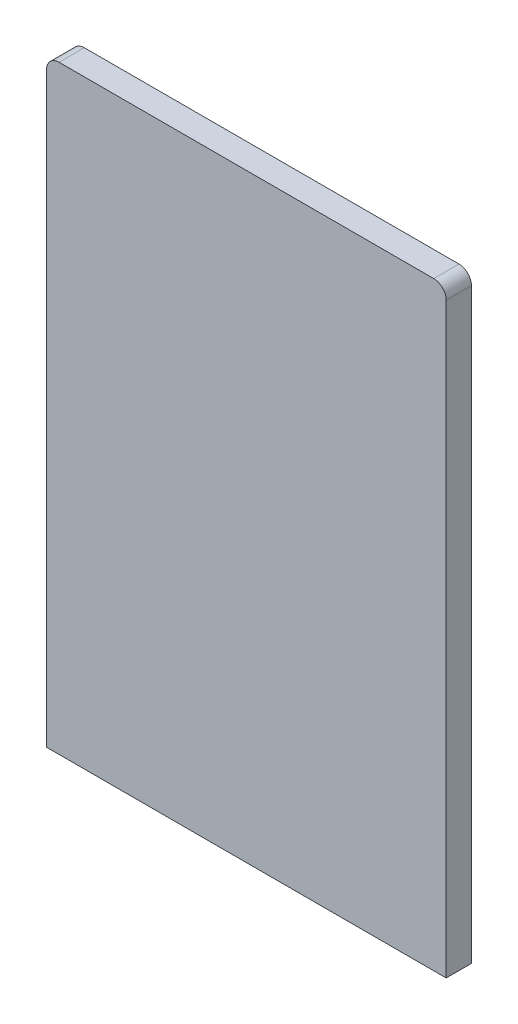
ISO-10303-21;
HEADER;
FILE_DESCRIPTION(('STEP AP214'),'2;1');
FILE_NAME('part.step','',(''),(''),'','','');
FILE_SCHEMA(('AUTOMOTIVE_DESIGN { 1 0 10303 214 1 1 1 1 }'));
ENDSEC;
DATA;
#1=APPLICATION_CONTEXT('core data for automotive mechanical design processes');
#2=APPLICATION_PROTOCOL_DEFINITION('international standard','automotive_design',2000,#1);
#3=PRODUCT_CONTEXT('',#1,'mechanical');
#4=PRODUCT('Part','Part','',(#3));
#5=PRODUCT_RELATED_PRODUCT_CATEGORY('part','',(#4));
#6=PRODUCT_DEFINITION_FORMATION('','',#4);
#7=PRODUCT_DEFINITION_CONTEXT('part definition',#1,'design');
#8=PRODUCT_DEFINITION('design','',#6,#7);
#9=PRODUCT_DEFINITION_SHAPE('','',#8);
#10=(LENGTH_UNIT() NAMED_UNIT(*) SI_UNIT(.MILLI.,.METRE.));
#11=(NAMED_UNIT(*) PLANE_ANGLE_UNIT() SI_UNIT($,.RADIAN.));
#12=(NAMED_UNIT(*) SI_UNIT($,.STERADIAN.) SOLID_ANGLE_UNIT());
#13=UNCERTAINTY_MEASURE_WITH_UNIT(LENGTH_MEASURE(1.E-05),#10,'distance_accuracy_value','');
#14=(GEOMETRIC_REPRESENTATION_CONTEXT(3) GLOBAL_UNCERTAINTY_ASSIGNED_CONTEXT((#13)) GLOBAL_UNIT_ASSIGNED_CONTEXT((#10,
#11,#12)) REPRESENTATION_CONTEXT('',''));
#15=CARTESIAN_POINT('',(0.,0.,0.));
#16=DIRECTION('',(0.,0.,1.));
#17=DIRECTION('',(1.,0.,0.));
#18=AXIS2_PLACEMENT_3D('',#15,#16,#17);
#19=CARTESIAN_POINT('',(4.,0.,0.105));
#20=DIRECTION('',(1.,0.,0.));
#21=DIRECTION('',(0.,1.,0.));
#22=AXIS2_PLACEMENT_3D('',#19,#20,#21);
#23=PLANE('',#22);
#24=DIRECTION('',(0.,0.,-1.));
#25=VECTOR('',#24,1.);
#26=CARTESIAN_POINT('',(4.,-8.,0.105));
#27=LINE('',#26,#25);
#28=CARTESIAN_POINT('',(4.,-8.,0.305));
#29=VERTEX_POINT('',#28);
#30=CARTESIAN_POINT('',(4.,-8.,-0.2));
#31=VERTEX_POINT('',#30);
#32=EDGE_CURVE('E188',#29,#31,#27,.T.);
#33=ORIENTED_EDGE('',*,*,#32,.T.);
#34=DIRECTION('',(0.,-1.,0.));
#35=VECTOR('',#34,1.);
#36=CARTESIAN_POINT('',(4.,0.,-0.2));
#37=LINE('',#36,#35);
#38=CARTESIAN_POINT('',(4.,3.75,-0.2));
#39=VERTEX_POINT('',#38);
#40=EDGE_CURVE('E175',#39,#31,#37,.T.);
#41=ORIENTED_EDGE('',*,*,#40,.F.);
#42=DIRECTION('',(0.,0.,-1.));
#43=VECTOR('',#42,1.);
#44=CARTESIAN_POINT('',(4.,3.75,0.105));
#45=LINE('',#44,#43);
#46=CARTESIAN_POINT('',(4.,3.75,0.305));
#47=VERTEX_POINT('',#46);
#48=EDGE_CURVE('E204',#39,#47,#45,.F.);
#49=ORIENTED_EDGE('',*,*,#48,.T.);
#50=DIRECTION('',(0.,1.,0.));
#51=VECTOR('',#50,1.);
#52=CARTESIAN_POINT('',(4.,0.,0.305));
#53=LINE('',#52,#51);
#54=EDGE_CURVE('E149',#29,#47,#53,.T.);
#55=ORIENTED_EDGE('',*,*,#54,.F.);
#56=EDGE_LOOP('',(#33,#41,#49,#55));
#57=FACE_BOUND('',#56,.T.);
#58=ADVANCED_FACE('F34',(#57),#23,.T.);
#59=CARTESIAN_POINT('',(0.,4.,0.105));
#60=DIRECTION('',(0.,1.,0.));
#61=DIRECTION('',(0.,0.,1.));
#62=AXIS2_PLACEMENT_3D('',#59,#60,#61);
#63=PLANE('',#62);
#64=DIRECTION('',(0.,0.,-1.));
#65=VECTOR('',#64,1.);
#66=CARTESIAN_POINT('',(3.75,4.,0.105));
#67=LINE('',#66,#65);
#68=CARTESIAN_POINT('',(3.75,4.,0.305));
#69=VERTEX_POINT('',#68);
#70=CARTESIAN_POINT('',(3.75,4.,-0.2));
#71=VERTEX_POINT('',#70);
#72=EDGE_CURVE('E124',#69,#71,#67,.T.);
#73=ORIENTED_EDGE('',*,*,#72,.T.);
#74=DIRECTION('',(1.,0.,0.));
#75=VECTOR('',#74,1.);
#76=CARTESIAN_POINT('',(0.,4.,-0.2));
#77=LINE('',#76,#75);
#78=CARTESIAN_POINT('',(-3.75,4.,-0.2));
#79=VERTEX_POINT('',#78);
#80=EDGE_CURVE('E172',#79,#71,#77,.T.);
#81=ORIENTED_EDGE('',*,*,#80,.F.);
#82=DIRECTION('',(0.,0.,-1.));
#83=VECTOR('',#82,1.);
#84=CARTESIAN_POINT('',(-3.75,4.,0.105));
#85=LINE('',#84,#83);
#86=CARTESIAN_POINT('',(-3.75,4.,0.305));
#87=VERTEX_POINT('',#86);
#88=EDGE_CURVE('E134',#79,#87,#85,.F.);
#89=ORIENTED_EDGE('',*,*,#88,.T.);
#90=DIRECTION('',(-1.,0.,0.));
#91=VECTOR('',#90,1.);
#92=CARTESIAN_POINT('',(0.,4.,0.305));
#93=LINE('',#92,#91);
#94=EDGE_CURVE('E138',#69,#87,#93,.T.);
#95=ORIENTED_EDGE('',*,*,#94,.F.);
#96=EDGE_LOOP('',(#73,#81,#89,#95));
#97=FACE_BOUND('',#96,.T.);
#98=ADVANCED_FACE('F139',(#97),#63,.T.);
#99=CARTESIAN_POINT('',(-4.,0.,0.105));
#100=DIRECTION('',(-1.,0.,0.));
#101=DIRECTION('',(0.,0.,1.));
#102=AXIS2_PLACEMENT_3D('',#99,#100,#101);
#103=PLANE('',#102);
#104=DIRECTION('',(0.,0.,-1.));
#105=VECTOR('',#104,1.);
#106=CARTESIAN_POINT('',(-4.,-8.,0.105));
#107=LINE('',#106,#105);
#108=CARTESIAN_POINT('',(-4.,-8.,0.305));
#109=VERTEX_POINT('',#108);
#110=CARTESIAN_POINT('',(-4.,-8.,-0.2));
#111=VERTEX_POINT('',#110);
#112=EDGE_CURVE('E200',#109,#111,#107,.T.);
#113=ORIENTED_EDGE('',*,*,#112,.F.);
#114=DIRECTION('',(0.,-1.,0.));
#115=VECTOR('',#114,1.);
#116=CARTESIAN_POINT('',(-4.,0.,0.305));
#117=LINE('',#116,#115);
#118=CARTESIAN_POINT('',(-4.,3.75,0.305));
#119=VERTEX_POINT('',#118);
#120=EDGE_CURVE('E156',#119,#109,#117,.T.);
#121=ORIENTED_EDGE('',*,*,#120,.F.);
#122=DIRECTION('',(0.,0.,-1.));
#123=VECTOR('',#122,1.);
#124=CARTESIAN_POINT('',(-4.,3.75,0.105));
#125=LINE('',#124,#123);
#126=CARTESIAN_POINT('',(-4.,3.75,-0.2));
#127=VERTEX_POINT('',#126);
#128=EDGE_CURVE('E135',#119,#127,#125,.T.);
#129=ORIENTED_EDGE('',*,*,#128,.T.);
#130=DIRECTION('',(0.,1.,0.));
#131=VECTOR('',#130,1.);
#132=CARTESIAN_POINT('',(-4.,0.,-0.2));
#133=LINE('',#132,#131);
#134=EDGE_CURVE('E166',#111,#127,#133,.T.);
#135=ORIENTED_EDGE('',*,*,#134,.F.);
#136=EDGE_LOOP('',(#113,#121,#129,#135));
#137=FACE_BOUND('',#136,.T.);
#138=ADVANCED_FACE('F250',(#137),#103,.T.);
#139=CARTESIAN_POINT('',(-2.75,0.,0.105));
#140=DIRECTION('',(1.,0.,0.));
#141=DIRECTION('',(0.,1.,0.));
#142=AXIS2_PLACEMENT_3D('',#139,#140,#141);
#143=PLANE('',#142);
#144=DIRECTION('',(0.,-1.,0.));
#145=VECTOR('',#144,1.);
#146=CARTESIAN_POINT('',(-2.75,0.,0.));
#147=LINE('',#146,#145);
#148=CARTESIAN_POINT('',(-2.75,2.5,0.));
#149=VERTEX_POINT('',#148);
#150=CARTESIAN_POINT('',(-2.75,-8.,0.));
#151=VERTEX_POINT('',#150);
#152=EDGE_CURVE('E178',#149,#151,#147,.T.);
#153=ORIENTED_EDGE('',*,*,#152,.F.);
#154=DIRECTION('',(0.,0.,-1.));
#155=VECTOR('',#154,1.);
#156=CARTESIAN_POINT('',(-2.75,2.5,0.105));
#157=LINE('',#156,#155);
#158=CARTESIAN_POINT('',(-2.75,2.5,0.105));
#159=VERTEX_POINT('',#158);
#160=EDGE_CURVE('E210',#149,#159,#157,.F.);
#161=ORIENTED_EDGE('',*,*,#160,.T.);
#162=DIRECTION('',(0.,-1.,0.));
#163=VECTOR('',#162,1.);
#164=CARTESIAN_POINT('',(-2.75,0.,0.105));
#165=LINE('',#164,#163);
#166=CARTESIAN_POINT('',(-2.75,-8.,0.105));
#167=VERTEX_POINT('',#166);
#168=EDGE_CURVE('E181',#159,#167,#165,.T.);
#169=ORIENTED_EDGE('',*,*,#168,.T.);
#170=DIRECTION('',(0.,0.,-1.));
#171=VECTOR('',#170,1.);
#172=CARTESIAN_POINT('',(-2.75,-8.,0.105));
#173=LINE('',#172,#171);
#174=EDGE_CURVE('E198',#167,#151,#173,.T.);
#175=ORIENTED_EDGE('',*,*,#174,.T.);
#176=EDGE_LOOP('',(#153,#161,#169,#175));
#177=FACE_BOUND('',#176,.T.);
#178=ADVANCED_FACE('F234',(#177),#143,.T.);
#179=CARTESIAN_POINT('',(0.,2.75,0.105));
#180=DIRECTION('',(0.,1.,0.));
#181=DIRECTION('',(0.,0.,1.));
#182=AXIS2_PLACEMENT_3D('',#179,#180,#181);
#183=PLANE('',#182);
#184=DIRECTION('',(1.,0.,0.));
#185=VECTOR('',#184,1.);
#186=CARTESIAN_POINT('',(0.,2.75,0.105));
#187=LINE('',#186,#185);
#188=CARTESIAN_POINT('',(-2.5,2.75,0.105));
#189=VERTEX_POINT('',#188);
#190=CARTESIAN_POINT('',(2.5,2.75,0.105));
#191=VERTEX_POINT('',#190);
#192=EDGE_CURVE('E183',#189,#191,#187,.T.);
#193=ORIENTED_EDGE('',*,*,#192,.F.);
#194=DIRECTION('',(0.,0.,-1.));
#195=VECTOR('',#194,1.);
#196=CARTESIAN_POINT('',(-2.5,2.75,0.105));
#197=LINE('',#196,#195);
#198=CARTESIAN_POINT('',(-2.5,2.75,0.));
#199=VERTEX_POINT('',#198);
#200=EDGE_CURVE('E207',#189,#199,#197,.T.);
#201=ORIENTED_EDGE('',*,*,#200,.T.);
#202=DIRECTION('',(1.,0.,0.));
#203=VECTOR('',#202,1.);
#204=CARTESIAN_POINT('',(0.,2.75,0.));
#205=LINE('',#204,#203);
#206=CARTESIAN_POINT('',(2.5,2.75,0.));
#207=VERTEX_POINT('',#206);
#208=EDGE_CURVE('E191',#199,#207,#205,.T.);
#209=ORIENTED_EDGE('',*,*,#208,.T.);
#210=DIRECTION('',(0.,0.,-1.));
#211=VECTOR('',#210,1.);
#212=CARTESIAN_POINT('',(2.5,2.75,0.105));
#213=LINE('',#212,#211);
#214=EDGE_CURVE('E57',#207,#191,#213,.F.);
#215=ORIENTED_EDGE('',*,*,#214,.T.);
#216=EDGE_LOOP('',(#193,#201,#209,#215));
#217=FACE_BOUND('',#216,.T.);
#218=ADVANCED_FACE('F242',(#217),#183,.F.);
#219=CARTESIAN_POINT('',(2.75,0.,0.105));
#220=DIRECTION('',(1.,0.,0.));
#221=DIRECTION('',(0.,1.,0.));
#222=AXIS2_PLACEMENT_3D('',#219,#220,#221);
#223=PLANE('',#222);
#224=DIRECTION('',(0.,-1.,0.));
#225=VECTOR('',#224,1.);
#226=CARTESIAN_POINT('',(2.75,0.,0.105));
#227=LINE('',#226,#225);
#228=CARTESIAN_POINT('',(2.75,2.5,0.105));
#229=VERTEX_POINT('',#228);
#230=CARTESIAN_POINT('',(2.75,-8.,0.105));
#231=VERTEX_POINT('',#230);
#232=EDGE_CURVE('E49',#229,#231,#227,.T.);
#233=ORIENTED_EDGE('',*,*,#232,.F.);
#234=DIRECTION('',(0.,0.,-1.));
#235=VECTOR('',#234,1.);
#236=CARTESIAN_POINT('',(2.75,2.5,0.));
#237=LINE('',#236,#235);
#238=CARTESIAN_POINT('',(2.75,2.5,0.));
#239=VERTEX_POINT('',#238);
#240=EDGE_CURVE('E212',#229,#239,#237,.T.);
#241=ORIENTED_EDGE('',*,*,#240,.T.);
#242=DIRECTION('',(0.,-1.,0.));
#243=VECTOR('',#242,1.);
#244=CARTESIAN_POINT('',(2.75,0.,0.));
#245=LINE('',#244,#243);
#246=CARTESIAN_POINT('',(2.75,-8.,0.));
#247=VERTEX_POINT('',#246);
#248=EDGE_CURVE('E184',#239,#247,#245,.T.);
#249=ORIENTED_EDGE('',*,*,#248,.T.);
#250=DIRECTION('',(0.,0.,-1.));
#251=VECTOR('',#250,1.);
#252=CARTESIAN_POINT('',(2.75,-8.,0.105));
#253=LINE('',#252,#251);
#254=EDGE_CURVE('E195',#231,#247,#253,.T.);
#255=ORIENTED_EDGE('',*,*,#254,.F.);
#256=EDGE_LOOP('',(#233,#241,#249,#255));
#257=FACE_BOUND('',#256,.T.);
#258=ADVANCED_FACE('F226',(#257),#223,.F.);
#259=CARTESIAN_POINT('',(0.,-8.,0.105));
#260=DIRECTION('',(0.,1.,0.));
#261=DIRECTION('',(0.,0.,1.));
#262=AXIS2_PLACEMENT_3D('',#259,#260,#261);
#263=PLANE('',#262);
#264=ORIENTED_EDGE('',*,*,#174,.F.);
#265=DIRECTION('',(1.,0.,0.));
#266=VECTOR('',#265,1.);
#267=CARTESIAN_POINT('',(0.,-8.,0.105));
#268=LINE('',#267,#266);
#269=EDGE_CURVE('E150',#167,#231,#268,.T.);
#270=ORIENTED_EDGE('',*,*,#269,.T.);
#271=ORIENTED_EDGE('',*,*,#254,.T.);
#272=DIRECTION('',(-1.,0.,0.));
#273=VECTOR('',#272,1.);
#274=CARTESIAN_POINT('',(0.,-8.,0.));
#275=LINE('',#274,#273);
#276=EDGE_CURVE('E161',#247,#151,#275,.T.);
#277=ORIENTED_EDGE('',*,*,#276,.T.);
#278=EDGE_LOOP('',(#264,#270,#271,#277));
#279=FACE_BOUND('',#278,.T.);
#280=DIRECTION('',(1.,0.,0.));
#281=VECTOR('',#280,1.);
#282=CARTESIAN_POINT('',(0.,-8.,0.305));
#283=LINE('',#282,#281);
#284=EDGE_CURVE('E159',#109,#29,#283,.T.);
#285=ORIENTED_EDGE('',*,*,#284,.F.);
#286=ORIENTED_EDGE('',*,*,#112,.T.);
#287=DIRECTION('',(-1.,0.,0.));
#288=VECTOR('',#287,1.);
#289=CARTESIAN_POINT('',(0.,-8.,-0.2));
#290=LINE('',#289,#288);
#291=EDGE_CURVE('E163',#31,#111,#290,.T.);
#292=ORIENTED_EDGE('',*,*,#291,.F.);
#293=ORIENTED_EDGE('',*,*,#32,.F.);
#294=EDGE_LOOP('',(#285,#286,#292,#293));
#295=FACE_BOUND('',#294,.T.);
#296=ADVANCED_FACE('F229',(#279,#295),#263,.F.);
#297=CARTESIAN_POINT('',(-3.75,3.75,0.105));
#298=DIRECTION('',(0.,0.,-1.));
#299=DIRECTION('',(-1.,0.,0.));
#300=AXIS2_PLACEMENT_3D('',#297,#298,#299);
#301=CYLINDRICAL_SURFACE('',#300,0.25);
#302=ORIENTED_EDGE('',*,*,#128,.F.);
#303=CARTESIAN_POINT('',(-3.75,3.75,0.305));
#304=DIRECTION('',(0.,0.,1.));
#305=DIRECTION('',(1.,0.,0.));
#306=AXIS2_PLACEMENT_3D('',#303,#304,#305);
#307=CIRCLE('',#306,0.25);
#308=EDGE_CURVE('E143',#87,#119,#307,.T.);
#309=ORIENTED_EDGE('',*,*,#308,.F.);
#310=ORIENTED_EDGE('',*,*,#88,.F.);
#311=CARTESIAN_POINT('',(-3.75,3.75,-0.2));
#312=DIRECTION('',(0.,0.,-1.));
#313=DIRECTION('',(-1.,0.,0.));
#314=AXIS2_PLACEMENT_3D('',#311,#312,#313);
#315=CIRCLE('',#314,0.25);
#316=EDGE_CURVE('E169',#127,#79,#315,.T.);
#317=ORIENTED_EDGE('',*,*,#316,.F.);
#318=EDGE_LOOP('',(#302,#309,#310,#317));
#319=FACE_BOUND('',#318,.T.);
#320=ADVANCED_FACE('F261',(#319),#301,.T.);
#321=CARTESIAN_POINT('',(3.75,3.75,0.105));
#322=DIRECTION('',(0.,0.,-1.));
#323=DIRECTION('',(-1.,0.,0.));
#324=AXIS2_PLACEMENT_3D('',#321,#322,#323);
#325=CYLINDRICAL_SURFACE('',#324,0.25);
#326=ORIENTED_EDGE('',*,*,#72,.F.);
#327=CARTESIAN_POINT('',(3.75,3.75,0.305));
#328=DIRECTION('',(0.,0.,1.));
#329=DIRECTION('',(1.,0.,0.));
#330=AXIS2_PLACEMENT_3D('',#327,#328,#329);
#331=CIRCLE('',#330,0.25);
#332=EDGE_CURVE('E128',#47,#69,#331,.T.);
#333=ORIENTED_EDGE('',*,*,#332,.F.);
#334=ORIENTED_EDGE('',*,*,#48,.F.);
#335=CARTESIAN_POINT('',(3.75,3.75,-0.2));
#336=DIRECTION('',(0.,0.,-1.));
#337=DIRECTION('',(-1.,0.,0.));
#338=AXIS2_PLACEMENT_3D('',#335,#336,#337);
#339=CIRCLE('',#338,0.25);
#340=EDGE_CURVE('E130',#71,#39,#339,.T.);
#341=ORIENTED_EDGE('',*,*,#340,.F.);
#342=EDGE_LOOP('',(#326,#333,#334,#341));
#343=FACE_BOUND('',#342,.T.);
#344=ADVANCED_FACE('F126',(#343),#325,.T.);
#345=CARTESIAN_POINT('',(-2.5,2.5,0.105));
#346=DIRECTION('',(0.,0.,-1.));
#347=DIRECTION('',(-1.,0.,0.));
#348=AXIS2_PLACEMENT_3D('',#345,#346,#347);
#349=CYLINDRICAL_SURFACE('',#348,0.25);
#350=CARTESIAN_POINT('',(-2.5,2.5,0.105));
#351=DIRECTION('',(0.,0.,1.));
#352=DIRECTION('',(1.,0.,0.));
#353=AXIS2_PLACEMENT_3D('',#350,#351,#352);
#354=CIRCLE('',#353,0.25);
#355=EDGE_CURVE('E217',#159,#189,#354,.F.);
#356=ORIENTED_EDGE('',*,*,#355,.F.);
#357=ORIENTED_EDGE('',*,*,#160,.F.);
#358=CARTESIAN_POINT('',(-2.5,2.5,0.));
#359=DIRECTION('',(0.,0.,1.));
#360=DIRECTION('',(1.,0.,0.));
#361=AXIS2_PLACEMENT_3D('',#358,#359,#360);
#362=CIRCLE('',#361,0.25);
#363=EDGE_CURVE('E214',#199,#149,#362,.T.);
#364=ORIENTED_EDGE('',*,*,#363,.F.);
#365=ORIENTED_EDGE('',*,*,#200,.F.);
#366=EDGE_LOOP('',(#356,#357,#364,#365));
#367=FACE_BOUND('',#366,.T.);
#368=ADVANCED_FACE('F237',(#367),#349,.F.);
#369=CARTESIAN_POINT('',(2.5,2.5,0.105));
#370=DIRECTION('',(0.,0.,1.));
#371=DIRECTION('',(1.,0.,0.));
#372=AXIS2_PLACEMENT_3D('',#369,#370,#371);
#373=CYLINDRICAL_SURFACE('',#372,0.25);
#374=CARTESIAN_POINT('',(2.5,2.5,0.105));
#375=DIRECTION('',(0.,0.,1.));
#376=DIRECTION('',(1.,0.,0.));
#377=AXIS2_PLACEMENT_3D('',#374,#375,#376);
#378=CIRCLE('',#377,0.25);
#379=EDGE_CURVE('E11',#191,#229,#378,.F.);
#380=ORIENTED_EDGE('',*,*,#379,.F.);
#381=ORIENTED_EDGE('',*,*,#214,.F.);
#382=CARTESIAN_POINT('',(2.5,2.5,0.));
#383=DIRECTION('',(0.,0.,1.));
#384=DIRECTION('',(1.,0.,0.));
#385=AXIS2_PLACEMENT_3D('',#382,#383,#384);
#386=CIRCLE('',#385,0.25);
#387=EDGE_CURVE('E42',#239,#207,#386,.T.);
#388=ORIENTED_EDGE('',*,*,#387,.F.);
#389=ORIENTED_EDGE('',*,*,#240,.F.);
#390=EDGE_LOOP('',(#380,#381,#388,#389));
#391=FACE_BOUND('',#390,.T.);
#392=ADVANCED_FACE('F36',(#391),#373,.F.);
#393=CARTESIAN_POINT('',(0.,0.,-0.2));
#394=DIRECTION('',(0.,0.,-1.));
#395=DIRECTION('',(-1.,0.,0.));
#396=AXIS2_PLACEMENT_3D('',#393,#394,#395);
#397=PLANE('',#396);
#398=ORIENTED_EDGE('',*,*,#291,.T.);
#399=ORIENTED_EDGE('',*,*,#134,.T.);
#400=ORIENTED_EDGE('',*,*,#316,.T.);
#401=ORIENTED_EDGE('',*,*,#80,.T.);
#402=ORIENTED_EDGE('',*,*,#340,.T.);
#403=ORIENTED_EDGE('',*,*,#40,.T.);
#404=EDGE_LOOP('',(#398,#399,#400,#401,#402,#403));
#405=FACE_BOUND('',#404,.T.);
#406=ADVANCED_FACE('F270',(#405),#397,.T.);
#407=CARTESIAN_POINT('',(0.,0.,0.));
#408=DIRECTION('',(0.,0.,-1.));
#409=DIRECTION('',(-1.,0.,0.));
#410=AXIS2_PLACEMENT_3D('',#407,#408,#409);
#411=PLANE('',#410);
#412=ORIENTED_EDGE('',*,*,#248,.F.);
#413=ORIENTED_EDGE('',*,*,#387,.T.);
#414=ORIENTED_EDGE('',*,*,#208,.F.);
#415=ORIENTED_EDGE('',*,*,#363,.T.);
#416=ORIENTED_EDGE('',*,*,#152,.T.);
#417=ORIENTED_EDGE('',*,*,#276,.F.);
#418=EDGE_LOOP('',(#412,#413,#414,#415,#416,#417));
#419=FACE_BOUND('',#418,.T.);
#420=ADVANCED_FACE('F223',(#419),#411,.F.);
#421=CARTESIAN_POINT('',(0.,0.,0.305));
#422=DIRECTION('',(0.,0.,1.));
#423=DIRECTION('',(1.,0.,0.));
#424=AXIS2_PLACEMENT_3D('',#421,#422,#423);
#425=PLANE('',#424);
#426=ORIENTED_EDGE('',*,*,#332,.T.);
#427=ORIENTED_EDGE('',*,*,#94,.T.);
#428=ORIENTED_EDGE('',*,*,#308,.T.);
#429=ORIENTED_EDGE('',*,*,#120,.T.);
#430=ORIENTED_EDGE('',*,*,#284,.T.);
#431=ORIENTED_EDGE('',*,*,#54,.T.);
#432=EDGE_LOOP('',(#426,#427,#428,#429,#430,#431));
#433=FACE_BOUND('',#432,.T.);
#434=ADVANCED_FACE('F146',(#433),#425,.T.);
#435=CARTESIAN_POINT('',(0.,0.,0.105));
#436=DIRECTION('',(0.,0.,1.));
#437=DIRECTION('',(1.,0.,0.));
#438=AXIS2_PLACEMENT_3D('',#435,#436,#437);
#439=PLANE('',#438);
#440=ORIENTED_EDGE('',*,*,#168,.F.);
#441=ORIENTED_EDGE('',*,*,#355,.T.);
#442=ORIENTED_EDGE('',*,*,#192,.T.);
#443=ORIENTED_EDGE('',*,*,#379,.T.);
#444=ORIENTED_EDGE('',*,*,#232,.T.);
#445=ORIENTED_EDGE('',*,*,#269,.F.);
#446=EDGE_LOOP('',(#440,#441,#442,#443,#444,#445));
#447=FACE_BOUND('',#446,.T.);
#448=ADVANCED_FACE('F241',(#447),#439,.F.);
#449=CLOSED_SHELL('',(#58,#98,#138,#178,#218,#258,#296,#320,#344,#368,#392,#406,#420,#434,#448));
#450=MANIFOLD_SOLID_BREP('B2',#449);
#451=ADVANCED_BREP_SHAPE_REPRESENTATION('',(#18,#450),#14);
#452=SHAPE_DEFINITION_REPRESENTATION(#9,#451);
ENDSEC;
END-ISO-10303-21;
